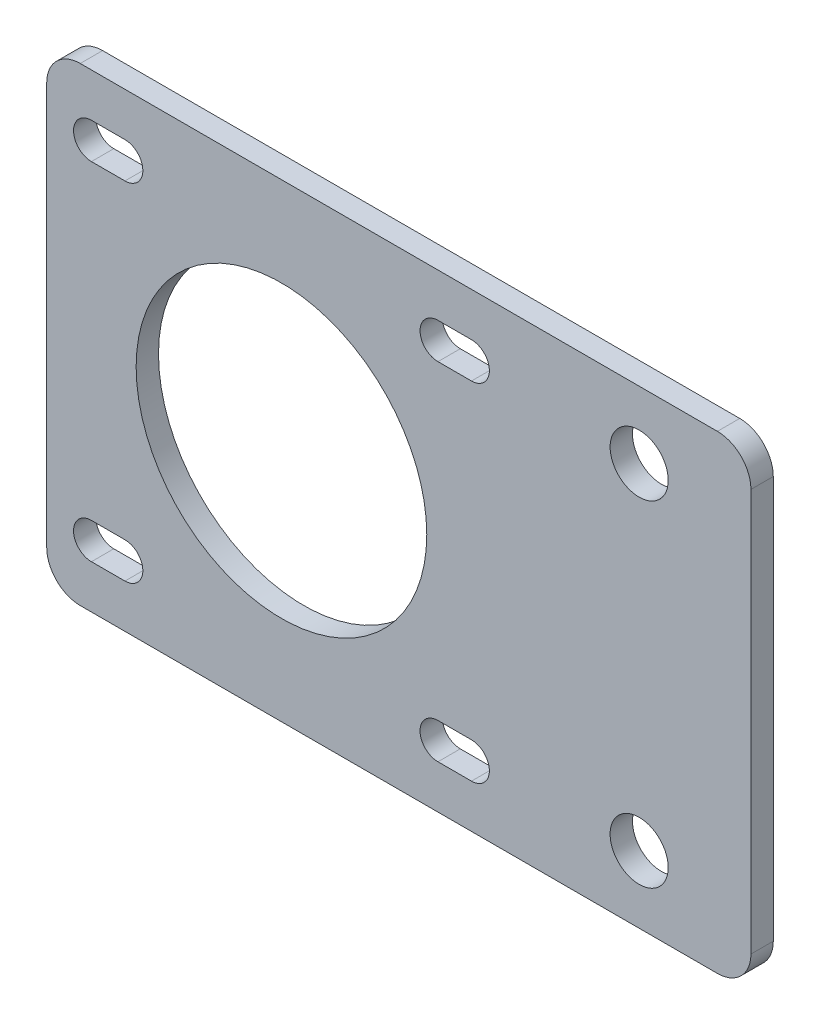
ISO-10303-21;
HEADER;
FILE_DESCRIPTION(('STEP AP214'),'2;1');
FILE_NAME('part.step','',(''),(''),'','','');
FILE_SCHEMA(('AUTOMOTIVE_DESIGN { 1 0 10303 214 1 1 1 1 }'));
ENDSEC;
DATA;
#1=APPLICATION_CONTEXT('core data for automotive mechanical design processes');
#2=APPLICATION_PROTOCOL_DEFINITION('international standard','automotive_design',2000,#1);
#3=PRODUCT_CONTEXT('',#1,'mechanical');
#4=PRODUCT('Part','Part','',(#3));
#5=PRODUCT_RELATED_PRODUCT_CATEGORY('part','',(#4));
#6=PRODUCT_DEFINITION_FORMATION('','',#4);
#7=PRODUCT_DEFINITION_CONTEXT('part definition',#1,'design');
#8=PRODUCT_DEFINITION('design','',#6,#7);
#9=PRODUCT_DEFINITION_SHAPE('','',#8);
#10=(LENGTH_UNIT() NAMED_UNIT(*) SI_UNIT(.MILLI.,.METRE.));
#11=(NAMED_UNIT(*) PLANE_ANGLE_UNIT() SI_UNIT($,.RADIAN.));
#12=(NAMED_UNIT(*) SI_UNIT($,.STERADIAN.) SOLID_ANGLE_UNIT());
#13=UNCERTAINTY_MEASURE_WITH_UNIT(LENGTH_MEASURE(1.E-05),#10,'distance_accuracy_value','');
#14=(GEOMETRIC_REPRESENTATION_CONTEXT(3) GLOBAL_UNCERTAINTY_ASSIGNED_CONTEXT((#13)) GLOBAL_UNIT_ASSIGNED_CONTEXT((#10,
#11,#12)) REPRESENTATION_CONTEXT('',''));
#15=CARTESIAN_POINT('',(0.,0.,0.));
#16=DIRECTION('',(0.,0.,1.));
#17=DIRECTION('',(1.,0.,0.));
#18=AXIS2_PLACEMENT_3D('',#15,#16,#17);
#19=CARTESIAN_POINT('',(39.,18.,-2.));
#20=DIRECTION('',(0.,0.,1.));
#21=DIRECTION('',(1.,0.,0.));
#22=AXIS2_PLACEMENT_3D('',#19,#20,#21);
#23=CYLINDRICAL_SURFACE('',#22,3.);
#24=CARTESIAN_POINT('',(39.,18.,0.));
#25=DIRECTION('',(0.,0.,1.));
#26=DIRECTION('',(1.,0.,0.));
#27=AXIS2_PLACEMENT_3D('',#24,#25,#26);
#28=CIRCLE('',#27,3.);
#29=CARTESIAN_POINT('',(42.,18.,0.));
#30=VERTEX_POINT('',#29);
#31=CARTESIAN_POINT('',(39.,21.,0.));
#32=VERTEX_POINT('',#31);
#33=EDGE_CURVE('E347',#30,#32,#28,.T.);
#34=ORIENTED_EDGE('',*,*,#33,.F.);
#35=DIRECTION('',(0.,0.,1.));
#36=VECTOR('',#35,1.);
#37=CARTESIAN_POINT('',(42.,18.,-2.));
#38=LINE('',#37,#36);
#39=CARTESIAN_POINT('',(42.,18.,-2.));
#40=VERTEX_POINT('',#39);
#41=EDGE_CURVE('E11',#40,#30,#38,.T.);
#42=ORIENTED_EDGE('',*,*,#41,.F.);
#43=CARTESIAN_POINT('',(39.,18.,-2.));
#44=DIRECTION('',(0.,0.,1.));
#45=DIRECTION('',(1.,0.,0.));
#46=AXIS2_PLACEMENT_3D('',#43,#44,#45);
#47=CIRCLE('',#46,3.);
#48=CARTESIAN_POINT('',(39.,21.,-2.));
#49=VERTEX_POINT('',#48);
#50=EDGE_CURVE('E350',#40,#49,#47,.T.);
#51=ORIENTED_EDGE('',*,*,#50,.T.);
#52=DIRECTION('',(0.,0.,1.));
#53=VECTOR('',#52,1.);
#54=CARTESIAN_POINT('',(39.,21.,-2.));
#55=LINE('',#54,#53);
#56=EDGE_CURVE('E41',#49,#32,#55,.T.);
#57=ORIENTED_EDGE('',*,*,#56,.T.);
#58=EDGE_LOOP('',(#34,#42,#51,#57));
#59=FACE_BOUND('',#58,.T.);
#60=ADVANCED_FACE('F38',(#59),#23,.T.);
#61=CARTESIAN_POINT('',(42.,18.,-2.));
#62=DIRECTION('',(1.,0.,0.));
#63=DIRECTION('',(0.,0.,-1.));
#64=AXIS2_PLACEMENT_3D('',#61,#62,#63);
#65=PLANE('',#64);
#66=DIRECTION('',(0.,1.,0.));
#67=VECTOR('',#66,1.);
#68=CARTESIAN_POINT('',(42.,18.,0.));
#69=LINE('',#68,#67);
#70=CARTESIAN_POINT('',(42.,-18.,0.));
#71=VERTEX_POINT('',#70);
#72=EDGE_CURVE('E354',#71,#30,#69,.T.);
#73=ORIENTED_EDGE('',*,*,#72,.F.);
#74=DIRECTION('',(0.,0.,1.));
#75=VECTOR('',#74,1.);
#76=CARTESIAN_POINT('',(42.,-18.,-2.));
#77=LINE('',#76,#75);
#78=CARTESIAN_POINT('',(42.,-18.,-2.));
#79=VERTEX_POINT('',#78);
#80=EDGE_CURVE('E46',#79,#71,#77,.T.);
#81=ORIENTED_EDGE('',*,*,#80,.F.);
#82=DIRECTION('',(0.,1.,0.));
#83=VECTOR('',#82,1.);
#84=CARTESIAN_POINT('',(42.,18.,-2.));
#85=LINE('',#84,#83);
#86=EDGE_CURVE('E372',#79,#40,#85,.T.);
#87=ORIENTED_EDGE('',*,*,#86,.T.);
#88=ORIENTED_EDGE('',*,*,#41,.T.);
#89=EDGE_LOOP('',(#73,#81,#87,#88));
#90=FACE_BOUND('',#89,.T.);
#91=ADVANCED_FACE('F419',(#90),#65,.T.);
#92=CARTESIAN_POINT('',(39.,-18.,-2.));
#93=DIRECTION('',(0.,0.,1.));
#94=DIRECTION('',(1.,0.,0.));
#95=AXIS2_PLACEMENT_3D('',#92,#93,#94);
#96=CYLINDRICAL_SURFACE('',#95,3.);
#97=CARTESIAN_POINT('',(39.,-18.,0.));
#98=DIRECTION('',(0.,0.,1.));
#99=DIRECTION('',(1.,0.,0.));
#100=AXIS2_PLACEMENT_3D('',#97,#98,#99);
#101=CIRCLE('',#100,3.);
#102=CARTESIAN_POINT('',(39.,-21.,0.));
#103=VERTEX_POINT('',#102);
#104=EDGE_CURVE('E392',#103,#71,#101,.T.);
#105=ORIENTED_EDGE('',*,*,#104,.F.);
#106=DIRECTION('',(0.,0.,1.));
#107=VECTOR('',#106,1.);
#108=CARTESIAN_POINT('',(39.,-21.,-2.));
#109=LINE('',#108,#107);
#110=CARTESIAN_POINT('',(39.,-21.,-2.));
#111=VERTEX_POINT('',#110);
#112=EDGE_CURVE('E398',#111,#103,#109,.T.);
#113=ORIENTED_EDGE('',*,*,#112,.F.);
#114=CARTESIAN_POINT('',(39.,-18.,-2.));
#115=DIRECTION('',(0.,0.,1.));
#116=DIRECTION('',(1.,0.,0.));
#117=AXIS2_PLACEMENT_3D('',#114,#115,#116);
#118=CIRCLE('',#117,3.);
#119=EDGE_CURVE('E369',#111,#79,#118,.T.);
#120=ORIENTED_EDGE('',*,*,#119,.T.);
#121=ORIENTED_EDGE('',*,*,#80,.T.);
#122=EDGE_LOOP('',(#105,#113,#120,#121));
#123=FACE_BOUND('',#122,.T.);
#124=ADVANCED_FACE('F439',(#123),#96,.T.);
#125=CARTESIAN_POINT('',(39.,-21.,-2.));
#126=DIRECTION('',(0.,-1.,0.));
#127=DIRECTION('',(1.,0.,0.));
#128=AXIS2_PLACEMENT_3D('',#125,#126,#127);
#129=PLANE('',#128);
#130=DIRECTION('',(1.,0.,0.));
#131=VECTOR('',#130,1.);
#132=CARTESIAN_POINT('',(39.,-21.,0.));
#133=LINE('',#132,#131);
#134=CARTESIAN_POINT('',(-18.,-21.,0.));
#135=VERTEX_POINT('',#134);
#136=EDGE_CURVE('E389',#135,#103,#133,.T.);
#137=ORIENTED_EDGE('',*,*,#136,.F.);
#138=DIRECTION('',(0.,0.,1.));
#139=VECTOR('',#138,1.);
#140=CARTESIAN_POINT('',(-18.,-21.,-2.));
#141=LINE('',#140,#139);
#142=CARTESIAN_POINT('',(-18.,-21.,-2.));
#143=VERTEX_POINT('',#142);
#144=EDGE_CURVE('E400',#143,#135,#141,.T.);
#145=ORIENTED_EDGE('',*,*,#144,.F.);
#146=DIRECTION('',(1.,0.,0.));
#147=VECTOR('',#146,1.);
#148=CARTESIAN_POINT('',(39.,-21.,-2.));
#149=LINE('',#148,#147);
#150=EDGE_CURVE('E366',#143,#111,#149,.T.);
#151=ORIENTED_EDGE('',*,*,#150,.T.);
#152=ORIENTED_EDGE('',*,*,#112,.T.);
#153=EDGE_LOOP('',(#137,#145,#151,#152));
#154=FACE_BOUND('',#153,.T.);
#155=ADVANCED_FACE('F437',(#154),#129,.T.);
#156=CARTESIAN_POINT('',(-18.,-18.,-2.));
#157=DIRECTION('',(0.,0.,1.));
#158=DIRECTION('',(1.,0.,0.));
#159=AXIS2_PLACEMENT_3D('',#156,#157,#158);
#160=CYLINDRICAL_SURFACE('',#159,3.);
#161=CARTESIAN_POINT('',(-18.,-18.,0.));
#162=DIRECTION('',(0.,0.,1.));
#163=DIRECTION('',(1.,0.,0.));
#164=AXIS2_PLACEMENT_3D('',#161,#162,#163);
#165=CIRCLE('',#164,3.);
#166=CARTESIAN_POINT('',(-21.,-18.,0.));
#167=VERTEX_POINT('',#166);
#168=EDGE_CURVE('E386',#167,#135,#165,.T.);
#169=ORIENTED_EDGE('',*,*,#168,.F.);
#170=DIRECTION('',(0.,0.,1.));
#171=VECTOR('',#170,1.);
#172=CARTESIAN_POINT('',(-21.,-18.,-2.));
#173=LINE('',#172,#171);
#174=CARTESIAN_POINT('',(-21.,-18.,-2.));
#175=VERTEX_POINT('',#174);
#176=EDGE_CURVE('E402',#175,#167,#173,.T.);
#177=ORIENTED_EDGE('',*,*,#176,.F.);
#178=CARTESIAN_POINT('',(-18.,-18.,-2.));
#179=DIRECTION('',(0.,0.,1.));
#180=DIRECTION('',(1.,0.,0.));
#181=AXIS2_PLACEMENT_3D('',#178,#179,#180);
#182=CIRCLE('',#181,3.);
#183=EDGE_CURVE('E363',#175,#143,#182,.T.);
#184=ORIENTED_EDGE('',*,*,#183,.T.);
#185=ORIENTED_EDGE('',*,*,#144,.T.);
#186=EDGE_LOOP('',(#169,#177,#184,#185));
#187=FACE_BOUND('',#186,.T.);
#188=ADVANCED_FACE('F433',(#187),#160,.T.);
#189=CARTESIAN_POINT('',(-21.,-18.,-2.));
#190=DIRECTION('',(-1.,0.,0.));
#191=DIRECTION('',(0.,0.,1.));
#192=AXIS2_PLACEMENT_3D('',#189,#190,#191);
#193=PLANE('',#192);
#194=DIRECTION('',(0.,-1.,0.));
#195=VECTOR('',#194,1.);
#196=CARTESIAN_POINT('',(-21.,-18.,0.));
#197=LINE('',#196,#195);
#198=CARTESIAN_POINT('',(-21.,18.,0.));
#199=VERTEX_POINT('',#198);
#200=EDGE_CURVE('E383',#199,#167,#197,.T.);
#201=ORIENTED_EDGE('',*,*,#200,.F.);
#202=DIRECTION('',(0.,0.,1.));
#203=VECTOR('',#202,1.);
#204=CARTESIAN_POINT('',(-21.,18.,-2.));
#205=LINE('',#204,#203);
#206=CARTESIAN_POINT('',(-21.,18.,-2.));
#207=VERTEX_POINT('',#206);
#208=EDGE_CURVE('E404',#207,#199,#205,.T.);
#209=ORIENTED_EDGE('',*,*,#208,.F.);
#210=DIRECTION('',(0.,-1.,0.));
#211=VECTOR('',#210,1.);
#212=CARTESIAN_POINT('',(-21.,-18.,-2.));
#213=LINE('',#212,#211);
#214=EDGE_CURVE('E360',#207,#175,#213,.T.);
#215=ORIENTED_EDGE('',*,*,#214,.T.);
#216=ORIENTED_EDGE('',*,*,#176,.T.);
#217=EDGE_LOOP('',(#201,#209,#215,#216));
#218=FACE_BOUND('',#217,.T.);
#219=ADVANCED_FACE('F431',(#218),#193,.T.);
#220=CARTESIAN_POINT('',(-18.,18.,-2.));
#221=DIRECTION('',(0.,0.,1.));
#222=DIRECTION('',(1.,0.,0.));
#223=AXIS2_PLACEMENT_3D('',#220,#221,#222);
#224=CYLINDRICAL_SURFACE('',#223,3.);
#225=CARTESIAN_POINT('',(-18.,18.,0.));
#226=DIRECTION('',(0.,0.,1.));
#227=DIRECTION('',(1.,0.,0.));
#228=AXIS2_PLACEMENT_3D('',#225,#226,#227);
#229=CIRCLE('',#228,3.);
#230=CARTESIAN_POINT('',(-18.,21.,0.));
#231=VERTEX_POINT('',#230);
#232=EDGE_CURVE('E380',#231,#199,#229,.T.);
#233=ORIENTED_EDGE('',*,*,#232,.F.);
#234=DIRECTION('',(0.,0.,1.));
#235=VECTOR('',#234,1.);
#236=CARTESIAN_POINT('',(-18.,21.,-2.));
#237=LINE('',#236,#235);
#238=CARTESIAN_POINT('',(-18.,21.,-2.));
#239=VERTEX_POINT('',#238);
#240=EDGE_CURVE('E405',#239,#231,#237,.T.);
#241=ORIENTED_EDGE('',*,*,#240,.F.);
#242=CARTESIAN_POINT('',(-18.,18.,-2.));
#243=DIRECTION('',(0.,0.,1.));
#244=DIRECTION('',(1.,0.,0.));
#245=AXIS2_PLACEMENT_3D('',#242,#243,#244);
#246=CIRCLE('',#245,3.);
#247=EDGE_CURVE('E357',#239,#207,#246,.T.);
#248=ORIENTED_EDGE('',*,*,#247,.T.);
#249=ORIENTED_EDGE('',*,*,#208,.T.);
#250=EDGE_LOOP('',(#233,#241,#248,#249));
#251=FACE_BOUND('',#250,.T.);
#252=ADVANCED_FACE('F427',(#251),#224,.T.);
#253=CARTESIAN_POINT('',(-18.,21.,-2.));
#254=DIRECTION('',(0.,1.,0.));
#255=DIRECTION('',(-1.,0.,0.));
#256=AXIS2_PLACEMENT_3D('',#253,#254,#255);
#257=PLANE('',#256);
#258=DIRECTION('',(-1.,0.,0.));
#259=VECTOR('',#258,1.);
#260=CARTESIAN_POINT('',(-18.,21.,0.));
#261=LINE('',#260,#259);
#262=EDGE_CURVE('E377',#32,#231,#261,.T.);
#263=ORIENTED_EDGE('',*,*,#262,.F.);
#264=ORIENTED_EDGE('',*,*,#56,.F.);
#265=DIRECTION('',(-1.,0.,0.));
#266=VECTOR('',#265,1.);
#267=CARTESIAN_POINT('',(-18.,21.,-2.));
#268=LINE('',#267,#266);
#269=EDGE_CURVE('E353',#49,#239,#268,.T.);
#270=ORIENTED_EDGE('',*,*,#269,.T.);
#271=ORIENTED_EDGE('',*,*,#240,.T.);
#272=EDGE_LOOP('',(#263,#264,#270,#271));
#273=FACE_BOUND('',#272,.T.);
#274=ADVANCED_FACE('F413',(#273),#257,.T.);
#275=CARTESIAN_POINT('',(39.,18.,-2.));
#276=DIRECTION('',(0.,0.,1.));
#277=DIRECTION('',(1.,0.,0.));
#278=AXIS2_PLACEMENT_3D('',#275,#276,#277);
#279=PLANE('',#278);
#280=DIRECTION('',(1.,0.,0.));
#281=VECTOR('',#280,1.);
#282=CARTESIAN_POINT('',(17.,-17.1,-2.));
#283=LINE('',#282,#281);
#284=CARTESIAN_POINT('',(14.,-17.1,-2.));
#285=VERTEX_POINT('',#284);
#286=CARTESIAN_POINT('',(17.,-17.1,-2.));
#287=VERTEX_POINT('',#286);
#288=EDGE_CURVE('E207',#285,#287,#283,.T.);
#289=ORIENTED_EDGE('',*,*,#288,.T.);
#290=CARTESIAN_POINT('',(17.,-15.5,-2.));
#291=DIRECTION('',(0.,0.,1.));
#292=DIRECTION('',(1.,0.,0.));
#293=AXIS2_PLACEMENT_3D('',#290,#291,#292);
#294=CIRCLE('',#293,1.6);
#295=CARTESIAN_POINT('',(17.,-13.9,-2.));
#296=VERTEX_POINT('',#295);
#297=EDGE_CURVE('E201',#287,#296,#294,.T.);
#298=ORIENTED_EDGE('',*,*,#297,.T.);
#299=DIRECTION('',(-1.,0.,0.));
#300=VECTOR('',#299,1.);
#301=CARTESIAN_POINT('',(17.,-13.9,-2.));
#302=LINE('',#301,#300);
#303=CARTESIAN_POINT('',(14.,-13.9,-2.));
#304=VERTEX_POINT('',#303);
#305=EDGE_CURVE('E210',#296,#304,#302,.T.);
#306=ORIENTED_EDGE('',*,*,#305,.T.);
#307=CARTESIAN_POINT('',(14.,-15.5,-2.));
#308=DIRECTION('',(0.,0.,1.));
#309=DIRECTION('',(1.,0.,0.));
#310=AXIS2_PLACEMENT_3D('',#307,#308,#309);
#311=CIRCLE('',#310,1.6);
#312=EDGE_CURVE('E54',#304,#285,#311,.T.);
#313=ORIENTED_EDGE('',*,*,#312,.T.);
#314=EDGE_LOOP('',(#289,#298,#306,#313));
#315=FACE_BOUND('',#314,.T.);
#316=DIRECTION('',(1.,0.,0.));
#317=VECTOR('',#316,1.);
#318=CARTESIAN_POINT('',(17.,13.9,-2.));
#319=LINE('',#318,#317);
#320=CARTESIAN_POINT('',(14.,13.9,-2.));
#321=VERTEX_POINT('',#320);
#322=CARTESIAN_POINT('',(17.,13.9,-2.));
#323=VERTEX_POINT('',#322);
#324=EDGE_CURVE('E246',#321,#323,#319,.T.);
#325=ORIENTED_EDGE('',*,*,#324,.T.);
#326=CARTESIAN_POINT('',(17.,15.5,-2.));
#327=DIRECTION('',(0.,0.,1.));
#328=DIRECTION('',(1.,0.,0.));
#329=AXIS2_PLACEMENT_3D('',#326,#327,#328);
#330=CIRCLE('',#329,1.6);
#331=CARTESIAN_POINT('',(17.,17.1,-2.));
#332=VERTEX_POINT('',#331);
#333=EDGE_CURVE('E236',#323,#332,#330,.T.);
#334=ORIENTED_EDGE('',*,*,#333,.T.);
#335=DIRECTION('',(-1.,0.,0.));
#336=VECTOR('',#335,1.);
#337=CARTESIAN_POINT('',(17.,17.1,-2.));
#338=LINE('',#337,#336);
#339=CARTESIAN_POINT('',(14.,17.1,-2.));
#340=VERTEX_POINT('',#339);
#341=EDGE_CURVE('E239',#332,#340,#338,.T.);
#342=ORIENTED_EDGE('',*,*,#341,.T.);
#343=CARTESIAN_POINT('',(14.,15.5,-2.));
#344=DIRECTION('',(0.,0.,1.));
#345=DIRECTION('',(1.,0.,0.));
#346=AXIS2_PLACEMENT_3D('',#343,#344,#345);
#347=CIRCLE('',#346,1.6);
#348=EDGE_CURVE('E243',#340,#321,#347,.T.);
#349=ORIENTED_EDGE('',*,*,#348,.T.);
#350=EDGE_LOOP('',(#325,#334,#342,#349));
#351=FACE_BOUND('',#350,.T.);
#352=DIRECTION('',(1.,0.,0.));
#353=VECTOR('',#352,1.);
#354=CARTESIAN_POINT('',(-14.,-17.1,-2.));
#355=LINE('',#354,#353);
#356=CARTESIAN_POINT('',(-17.,-17.1,-2.));
#357=VERTEX_POINT('',#356);
#358=CARTESIAN_POINT('',(-14.,-17.1,-2.));
#359=VERTEX_POINT('',#358);
#360=EDGE_CURVE('E278',#357,#359,#355,.T.);
#361=ORIENTED_EDGE('',*,*,#360,.T.);
#362=CARTESIAN_POINT('',(-14.,-15.5,-2.));
#363=DIRECTION('',(0.,0.,1.));
#364=DIRECTION('',(1.,0.,0.));
#365=AXIS2_PLACEMENT_3D('',#362,#363,#364);
#366=CIRCLE('',#365,1.6);
#367=CARTESIAN_POINT('',(-14.,-13.9,-2.));
#368=VERTEX_POINT('',#367);
#369=EDGE_CURVE('E268',#359,#368,#366,.T.);
#370=ORIENTED_EDGE('',*,*,#369,.T.);
#371=DIRECTION('',(-1.,0.,0.));
#372=VECTOR('',#371,1.);
#373=CARTESIAN_POINT('',(-14.,-13.9,-2.));
#374=LINE('',#373,#372);
#375=CARTESIAN_POINT('',(-17.,-13.9,-2.));
#376=VERTEX_POINT('',#375);
#377=EDGE_CURVE('E271',#368,#376,#374,.T.);
#378=ORIENTED_EDGE('',*,*,#377,.T.);
#379=CARTESIAN_POINT('',(-17.,-15.5,-2.));
#380=DIRECTION('',(0.,0.,1.));
#381=DIRECTION('',(1.,0.,0.));
#382=AXIS2_PLACEMENT_3D('',#379,#380,#381);
#383=CIRCLE('',#382,1.6);
#384=EDGE_CURVE('E275',#376,#357,#383,.T.);
#385=ORIENTED_EDGE('',*,*,#384,.T.);
#386=EDGE_LOOP('',(#361,#370,#378,#385));
#387=FACE_BOUND('',#386,.T.);
#388=CARTESIAN_POINT('',(32.,15.,-2.));
#389=DIRECTION('',(0.,0.,1.));
#390=DIRECTION('',(1.,0.,0.));
#391=AXIS2_PLACEMENT_3D('',#388,#389,#390);
#392=CIRCLE('',#391,2.6);
#393=CARTESIAN_POINT('',(34.6,15.,-2.));
#394=VERTEX_POINT('',#393);
#395=EDGE_CURVE('E300',#394,#394,#392,.T.);
#396=ORIENTED_EDGE('',*,*,#395,.T.);
#397=EDGE_LOOP('',(#396));
#398=FACE_BOUND('',#397,.T.);
#399=CARTESIAN_POINT('',(32.,-15.,-2.));
#400=DIRECTION('',(0.,0.,1.));
#401=DIRECTION('',(1.,0.,0.));
#402=AXIS2_PLACEMENT_3D('',#399,#400,#401);
#403=CIRCLE('',#402,2.6);
#404=CARTESIAN_POINT('',(34.6,-15.,-2.));
#405=VERTEX_POINT('',#404);
#406=EDGE_CURVE('E306',#405,#405,#403,.T.);
#407=ORIENTED_EDGE('',*,*,#406,.T.);
#408=EDGE_LOOP('',(#407));
#409=FACE_BOUND('',#408,.T.);
#410=DIRECTION('',(1.,0.,0.));
#411=VECTOR('',#410,1.);
#412=CARTESIAN_POINT('',(-14.,13.9,-2.));
#413=LINE('',#412,#411);
#414=CARTESIAN_POINT('',(-17.,13.9,-2.));
#415=VERTEX_POINT('',#414);
#416=CARTESIAN_POINT('',(-14.,13.9,-2.));
#417=VERTEX_POINT('',#416);
#418=EDGE_CURVE('E322',#415,#417,#413,.T.);
#419=ORIENTED_EDGE('',*,*,#418,.T.);
#420=CARTESIAN_POINT('',(-14.,15.5,-2.));
#421=DIRECTION('',(0.,0.,1.));
#422=DIRECTION('',(1.,0.,0.));
#423=AXIS2_PLACEMENT_3D('',#420,#421,#422);
#424=CIRCLE('',#423,1.6);
#425=CARTESIAN_POINT('',(-14.,17.1,-2.));
#426=VERTEX_POINT('',#425);
#427=EDGE_CURVE('E312',#417,#426,#424,.T.);
#428=ORIENTED_EDGE('',*,*,#427,.T.);
#429=DIRECTION('',(-1.,0.,0.));
#430=VECTOR('',#429,1.);
#431=CARTESIAN_POINT('',(-14.,17.1,-2.));
#432=LINE('',#431,#430);
#433=CARTESIAN_POINT('',(-17.,17.1,-2.));
#434=VERTEX_POINT('',#433);
#435=EDGE_CURVE('E315',#426,#434,#432,.T.);
#436=ORIENTED_EDGE('',*,*,#435,.T.);
#437=CARTESIAN_POINT('',(-17.,15.5,-2.));
#438=DIRECTION('',(0.,0.,1.));
#439=DIRECTION('',(1.,0.,0.));
#440=AXIS2_PLACEMENT_3D('',#437,#438,#439);
#441=CIRCLE('',#440,1.6);
#442=EDGE_CURVE('E319',#434,#415,#441,.T.);
#443=ORIENTED_EDGE('',*,*,#442,.T.);
#444=EDGE_LOOP('',(#419,#428,#436,#443));
#445=FACE_BOUND('',#444,.T.);
#446=CARTESIAN_POINT('',(0.,0.,-2.));
#447=DIRECTION('',(0.,0.,1.));
#448=DIRECTION('',(1.,0.,0.));
#449=AXIS2_PLACEMENT_3D('',#446,#447,#448);
#450=CIRCLE('',#449,13.);
#451=CARTESIAN_POINT('',(13.,0.,-2.));
#452=VERTEX_POINT('',#451);
#453=EDGE_CURVE('E344',#452,#452,#450,.T.);
#454=ORIENTED_EDGE('',*,*,#453,.T.);
#455=EDGE_LOOP('',(#454));
#456=FACE_BOUND('',#455,.T.);
#457=ORIENTED_EDGE('',*,*,#50,.F.);
#458=ORIENTED_EDGE('',*,*,#86,.F.);
#459=ORIENTED_EDGE('',*,*,#119,.F.);
#460=ORIENTED_EDGE('',*,*,#150,.F.);
#461=ORIENTED_EDGE('',*,*,#183,.F.);
#462=ORIENTED_EDGE('',*,*,#214,.F.);
#463=ORIENTED_EDGE('',*,*,#247,.F.);
#464=ORIENTED_EDGE('',*,*,#269,.F.);
#465=EDGE_LOOP('',(#457,#458,#459,#460,#461,#462,#463,#464));
#466=FACE_BOUND('',#465,.T.);
#467=ADVANCED_FACE('F214',(#315,#351,#387,#398,#409,#445,#456,#466),#279,.F.);
#468=CARTESIAN_POINT('',(39.,18.,0.));
#469=DIRECTION('',(0.,0.,1.));
#470=DIRECTION('',(1.,0.,0.));
#471=AXIS2_PLACEMENT_3D('',#468,#469,#470);
#472=PLANE('',#471);
#473=CARTESIAN_POINT('',(17.,-15.5,0.));
#474=DIRECTION('',(0.,0.,1.));
#475=DIRECTION('',(1.,0.,0.));
#476=AXIS2_PLACEMENT_3D('',#473,#474,#475);
#477=CIRCLE('',#476,1.6);
#478=CARTESIAN_POINT('',(17.,-17.1,0.));
#479=VERTEX_POINT('',#478);
#480=CARTESIAN_POINT('',(17.,-13.9,0.));
#481=VERTEX_POINT('',#480);
#482=EDGE_CURVE('E62',#479,#481,#477,.T.);
#483=ORIENTED_EDGE('',*,*,#482,.F.);
#484=DIRECTION('',(1.,0.,0.));
#485=VECTOR('',#484,1.);
#486=CARTESIAN_POINT('',(17.,-17.1,0.));
#487=LINE('',#486,#485);
#488=CARTESIAN_POINT('',(14.,-17.1,0.));
#489=VERTEX_POINT('',#488);
#490=EDGE_CURVE('E217',#489,#479,#487,.T.);
#491=ORIENTED_EDGE('',*,*,#490,.F.);
#492=CARTESIAN_POINT('',(14.,-15.5,0.));
#493=DIRECTION('',(0.,0.,1.));
#494=DIRECTION('',(1.,0.,0.));
#495=AXIS2_PLACEMENT_3D('',#492,#493,#494);
#496=CIRCLE('',#495,1.6);
#497=CARTESIAN_POINT('',(14.,-13.9,0.));
#498=VERTEX_POINT('',#497);
#499=EDGE_CURVE('E220',#498,#489,#496,.T.);
#500=ORIENTED_EDGE('',*,*,#499,.F.);
#501=DIRECTION('',(-1.,0.,0.));
#502=VECTOR('',#501,1.);
#503=CARTESIAN_POINT('',(17.,-13.9,0.));
#504=LINE('',#503,#502);
#505=EDGE_CURVE('E226',#481,#498,#504,.T.);
#506=ORIENTED_EDGE('',*,*,#505,.F.);
#507=EDGE_LOOP('',(#483,#491,#500,#506));
#508=FACE_BOUND('',#507,.T.);
#509=CARTESIAN_POINT('',(17.,15.5,0.));
#510=DIRECTION('',(0.,0.,1.));
#511=DIRECTION('',(1.,0.,0.));
#512=AXIS2_PLACEMENT_3D('',#509,#510,#511);
#513=CIRCLE('',#512,1.6);
#514=CARTESIAN_POINT('',(17.,13.9,0.));
#515=VERTEX_POINT('',#514);
#516=CARTESIAN_POINT('',(17.,17.1,0.));
#517=VERTEX_POINT('',#516);
#518=EDGE_CURVE('E232',#515,#517,#513,.T.);
#519=ORIENTED_EDGE('',*,*,#518,.F.);
#520=DIRECTION('',(1.,0.,0.));
#521=VECTOR('',#520,1.);
#522=CARTESIAN_POINT('',(17.,13.9,0.));
#523=LINE('',#522,#521);
#524=CARTESIAN_POINT('',(14.,13.9,0.));
#525=VERTEX_POINT('',#524);
#526=EDGE_CURVE('E240',#525,#515,#523,.T.);
#527=ORIENTED_EDGE('',*,*,#526,.F.);
#528=CARTESIAN_POINT('',(14.,15.5,0.));
#529=DIRECTION('',(0.,0.,1.));
#530=DIRECTION('',(1.,0.,0.));
#531=AXIS2_PLACEMENT_3D('',#528,#529,#530);
#532=CIRCLE('',#531,1.6);
#533=CARTESIAN_POINT('',(14.,17.1,0.));
#534=VERTEX_POINT('',#533);
#535=EDGE_CURVE('E254',#534,#525,#532,.T.);
#536=ORIENTED_EDGE('',*,*,#535,.F.);
#537=DIRECTION('',(-1.,0.,0.));
#538=VECTOR('',#537,1.);
#539=CARTESIAN_POINT('',(17.,17.1,0.));
#540=LINE('',#539,#538);
#541=EDGE_CURVE('E251',#517,#534,#540,.T.);
#542=ORIENTED_EDGE('',*,*,#541,.F.);
#543=EDGE_LOOP('',(#519,#527,#536,#542));
#544=FACE_BOUND('',#543,.T.);
#545=CARTESIAN_POINT('',(-14.,-15.5,0.));
#546=DIRECTION('',(0.,0.,1.));
#547=DIRECTION('',(1.,0.,0.));
#548=AXIS2_PLACEMENT_3D('',#545,#546,#547);
#549=CIRCLE('',#548,1.6);
#550=CARTESIAN_POINT('',(-14.,-17.1,0.));
#551=VERTEX_POINT('',#550);
#552=CARTESIAN_POINT('',(-14.,-13.9,0.));
#553=VERTEX_POINT('',#552);
#554=EDGE_CURVE('E261',#551,#553,#549,.T.);
#555=ORIENTED_EDGE('',*,*,#554,.F.);
#556=DIRECTION('',(1.,0.,0.));
#557=VECTOR('',#556,1.);
#558=CARTESIAN_POINT('',(-14.,-17.1,0.));
#559=LINE('',#558,#557);
#560=CARTESIAN_POINT('',(-17.,-17.1,0.));
#561=VERTEX_POINT('',#560);
#562=EDGE_CURVE('E272',#561,#551,#559,.T.);
#563=ORIENTED_EDGE('',*,*,#562,.F.);
#564=CARTESIAN_POINT('',(-17.,-15.5,0.));
#565=DIRECTION('',(0.,0.,1.));
#566=DIRECTION('',(1.,0.,0.));
#567=AXIS2_PLACEMENT_3D('',#564,#565,#566);
#568=CIRCLE('',#567,1.6);
#569=CARTESIAN_POINT('',(-17.,-13.9,0.));
#570=VERTEX_POINT('',#569);
#571=EDGE_CURVE('E286',#570,#561,#568,.T.);
#572=ORIENTED_EDGE('',*,*,#571,.F.);
#573=DIRECTION('',(-1.,0.,0.));
#574=VECTOR('',#573,1.);
#575=CARTESIAN_POINT('',(-14.,-13.9,0.));
#576=LINE('',#575,#574);
#577=EDGE_CURVE('E283',#553,#570,#576,.T.);
#578=ORIENTED_EDGE('',*,*,#577,.F.);
#579=EDGE_LOOP('',(#555,#563,#572,#578));
#580=FACE_BOUND('',#579,.T.);
#581=CARTESIAN_POINT('',(32.,15.,0.));
#582=DIRECTION('',(0.,0.,1.));
#583=DIRECTION('',(1.,0.,0.));
#584=AXIS2_PLACEMENT_3D('',#581,#582,#583);
#585=CIRCLE('',#584,2.6);
#586=CARTESIAN_POINT('',(34.6,15.,0.));
#587=VERTEX_POINT('',#586);
#588=EDGE_CURVE('E293',#587,#587,#585,.T.);
#589=ORIENTED_EDGE('',*,*,#588,.F.);
#590=EDGE_LOOP('',(#589));
#591=FACE_BOUND('',#590,.T.);
#592=CARTESIAN_POINT('',(32.,-15.,0.));
#593=DIRECTION('',(0.,0.,1.));
#594=DIRECTION('',(1.,0.,0.));
#595=AXIS2_PLACEMENT_3D('',#592,#593,#594);
#596=CIRCLE('',#595,2.6);
#597=CARTESIAN_POINT('',(34.6,-15.,0.));
#598=VERTEX_POINT('',#597);
#599=EDGE_CURVE('E303',#598,#598,#596,.T.);
#600=ORIENTED_EDGE('',*,*,#599,.F.);
#601=EDGE_LOOP('',(#600));
#602=FACE_BOUND('',#601,.T.);
#603=CARTESIAN_POINT('',(-14.,15.5,0.));
#604=DIRECTION('',(0.,0.,1.));
#605=DIRECTION('',(1.,0.,0.));
#606=AXIS2_PLACEMENT_3D('',#603,#604,#605);
#607=CIRCLE('',#606,1.6);
#608=CARTESIAN_POINT('',(-14.,13.9,0.));
#609=VERTEX_POINT('',#608);
#610=CARTESIAN_POINT('',(-14.,17.1,0.));
#611=VERTEX_POINT('',#610);
#612=EDGE_CURVE('E309',#609,#611,#607,.T.);
#613=ORIENTED_EDGE('',*,*,#612,.F.);
#614=DIRECTION('',(1.,0.,0.));
#615=VECTOR('',#614,1.);
#616=CARTESIAN_POINT('',(-14.,13.9,0.));
#617=LINE('',#616,#615);
#618=CARTESIAN_POINT('',(-17.,13.9,0.));
#619=VERTEX_POINT('',#618);
#620=EDGE_CURVE('E316',#619,#609,#617,.T.);
#621=ORIENTED_EDGE('',*,*,#620,.F.);
#622=CARTESIAN_POINT('',(-17.,15.5,0.));
#623=DIRECTION('',(0.,0.,1.));
#624=DIRECTION('',(1.,0.,0.));
#625=AXIS2_PLACEMENT_3D('',#622,#623,#624);
#626=CIRCLE('',#625,1.6);
#627=CARTESIAN_POINT('',(-17.,17.1,0.));
#628=VERTEX_POINT('',#627);
#629=EDGE_CURVE('E330',#628,#619,#626,.T.);
#630=ORIENTED_EDGE('',*,*,#629,.F.);
#631=DIRECTION('',(-1.,0.,0.));
#632=VECTOR('',#631,1.);
#633=CARTESIAN_POINT('',(-14.,17.1,0.));
#634=LINE('',#633,#632);
#635=EDGE_CURVE('E327',#611,#628,#634,.T.);
#636=ORIENTED_EDGE('',*,*,#635,.F.);
#637=EDGE_LOOP('',(#613,#621,#630,#636));
#638=FACE_BOUND('',#637,.T.);
#639=CARTESIAN_POINT('',(0.,0.,0.));
#640=DIRECTION('',(0.,0.,1.));
#641=DIRECTION('',(1.,0.,0.));
#642=AXIS2_PLACEMENT_3D('',#639,#640,#641);
#643=CIRCLE('',#642,13.);
#644=CARTESIAN_POINT('',(13.,0.,0.));
#645=VERTEX_POINT('',#644);
#646=EDGE_CURVE('E337',#645,#645,#643,.T.);
#647=ORIENTED_EDGE('',*,*,#646,.F.);
#648=EDGE_LOOP('',(#647));
#649=FACE_BOUND('',#648,.T.);
#650=ORIENTED_EDGE('',*,*,#33,.T.);
#651=ORIENTED_EDGE('',*,*,#262,.T.);
#652=ORIENTED_EDGE('',*,*,#232,.T.);
#653=ORIENTED_EDGE('',*,*,#200,.T.);
#654=ORIENTED_EDGE('',*,*,#168,.T.);
#655=ORIENTED_EDGE('',*,*,#136,.T.);
#656=ORIENTED_EDGE('',*,*,#104,.T.);
#657=ORIENTED_EDGE('',*,*,#72,.T.);
#658=EDGE_LOOP('',(#650,#651,#652,#653,#654,#655,#656,#657));
#659=FACE_BOUND('',#658,.T.);
#660=ADVANCED_FACE('F415',(#508,#544,#580,#591,#602,#638,#649,#659),#472,.T.);
#661=CARTESIAN_POINT('',(0.,0.,-2.));
#662=DIRECTION('',(0.,0.,1.));
#663=DIRECTION('',(1.,0.,0.));
#664=AXIS2_PLACEMENT_3D('',#661,#662,#663);
#665=CYLINDRICAL_SURFACE('',#664,13.);
#666=ORIENTED_EDGE('',*,*,#453,.F.);
#667=EDGE_LOOP('',(#666));
#668=FACE_BOUND('',#667,.T.);
#669=ORIENTED_EDGE('',*,*,#646,.T.);
#670=EDGE_LOOP('',(#669));
#671=FACE_BOUND('',#670,.T.);
#672=ADVANCED_FACE('F521',(#668,#671),#665,.F.);
#673=CARTESIAN_POINT('',(-14.,15.5,-2.));
#674=DIRECTION('',(0.,0.,1.));
#675=DIRECTION('',(1.,0.,0.));
#676=AXIS2_PLACEMENT_3D('',#673,#674,#675);
#677=CYLINDRICAL_SURFACE('',#676,1.6);
#678=ORIENTED_EDGE('',*,*,#612,.T.);
#679=DIRECTION('',(0.,0.,1.));
#680=VECTOR('',#679,1.);
#681=CARTESIAN_POINT('',(-14.,17.1,-2.));
#682=LINE('',#681,#680);
#683=EDGE_CURVE('E325',#426,#611,#682,.T.);
#684=ORIENTED_EDGE('',*,*,#683,.F.);
#685=ORIENTED_EDGE('',*,*,#427,.F.);
#686=DIRECTION('',(0.,0.,1.));
#687=VECTOR('',#686,1.);
#688=CARTESIAN_POINT('',(-14.,13.9,-2.));
#689=LINE('',#688,#687);
#690=EDGE_CURVE('E335',#417,#609,#689,.T.);
#691=ORIENTED_EDGE('',*,*,#690,.T.);
#692=EDGE_LOOP('',(#678,#684,#685,#691));
#693=FACE_BOUND('',#692,.T.);
#694=ADVANCED_FACE('F532',(#693),#677,.F.);
#695=CARTESIAN_POINT('',(-14.,13.9,-2.));
#696=DIRECTION('',(0.,-1.,0.));
#697=DIRECTION('',(0.,0.,-1.));
#698=AXIS2_PLACEMENT_3D('',#695,#696,#697);
#699=PLANE('',#698);
#700=ORIENTED_EDGE('',*,*,#620,.T.);
#701=ORIENTED_EDGE('',*,*,#690,.F.);
#702=ORIENTED_EDGE('',*,*,#418,.F.);
#703=DIRECTION('',(0.,0.,1.));
#704=VECTOR('',#703,1.);
#705=CARTESIAN_POINT('',(-17.,13.9,-2.));
#706=LINE('',#705,#704);
#707=EDGE_CURVE('E338',#415,#619,#706,.T.);
#708=ORIENTED_EDGE('',*,*,#707,.T.);
#709=EDGE_LOOP('',(#700,#701,#702,#708));
#710=FACE_BOUND('',#709,.T.);
#711=ADVANCED_FACE('F543',(#710),#699,.F.);
#712=CARTESIAN_POINT('',(-17.,15.5,-2.));
#713=DIRECTION('',(0.,0.,1.));
#714=DIRECTION('',(1.,0.,0.));
#715=AXIS2_PLACEMENT_3D('',#712,#713,#714);
#716=CYLINDRICAL_SURFACE('',#715,1.6);
#717=ORIENTED_EDGE('',*,*,#629,.T.);
#718=ORIENTED_EDGE('',*,*,#707,.F.);
#719=ORIENTED_EDGE('',*,*,#442,.F.);
#720=DIRECTION('',(0.,0.,1.));
#721=VECTOR('',#720,1.);
#722=CARTESIAN_POINT('',(-17.,17.1,-2.));
#723=LINE('',#722,#721);
#724=EDGE_CURVE('E340',#434,#628,#723,.T.);
#725=ORIENTED_EDGE('',*,*,#724,.T.);
#726=EDGE_LOOP('',(#717,#718,#719,#725));
#727=FACE_BOUND('',#726,.T.);
#728=ADVANCED_FACE('F554',(#727),#716,.F.);
#729=CARTESIAN_POINT('',(-14.,17.1,-2.));
#730=DIRECTION('',(0.,1.,0.));
#731=DIRECTION('',(0.,0.,1.));
#732=AXIS2_PLACEMENT_3D('',#729,#730,#731);
#733=PLANE('',#732);
#734=ORIENTED_EDGE('',*,*,#635,.T.);
#735=ORIENTED_EDGE('',*,*,#724,.F.);
#736=ORIENTED_EDGE('',*,*,#435,.F.);
#737=ORIENTED_EDGE('',*,*,#683,.T.);
#738=EDGE_LOOP('',(#734,#735,#736,#737));
#739=FACE_BOUND('',#738,.T.);
#740=ADVANCED_FACE('F565',(#739),#733,.F.);
#741=CARTESIAN_POINT('',(32.,-15.,-2.));
#742=DIRECTION('',(0.,0.,1.));
#743=DIRECTION('',(1.,0.,0.));
#744=AXIS2_PLACEMENT_3D('',#741,#742,#743);
#745=CYLINDRICAL_SURFACE('',#744,2.6);
#746=ORIENTED_EDGE('',*,*,#406,.F.);
#747=EDGE_LOOP('',(#746));
#748=FACE_BOUND('',#747,.T.);
#749=ORIENTED_EDGE('',*,*,#599,.T.);
#750=EDGE_LOOP('',(#749));
#751=FACE_BOUND('',#750,.T.);
#752=ADVANCED_FACE('F576',(#748,#751),#745,.F.);
#753=CARTESIAN_POINT('',(32.,15.,-2.));
#754=DIRECTION('',(0.,0.,1.));
#755=DIRECTION('',(1.,0.,0.));
#756=AXIS2_PLACEMENT_3D('',#753,#754,#755);
#757=CYLINDRICAL_SURFACE('',#756,2.6);
#758=ORIENTED_EDGE('',*,*,#395,.F.);
#759=EDGE_LOOP('',(#758));
#760=FACE_BOUND('',#759,.T.);
#761=ORIENTED_EDGE('',*,*,#588,.T.);
#762=EDGE_LOOP('',(#761));
#763=FACE_BOUND('',#762,.T.);
#764=ADVANCED_FACE('F587',(#760,#763),#757,.F.);
#765=CARTESIAN_POINT('',(-14.,-15.5,-2.));
#766=DIRECTION('',(0.,0.,1.));
#767=DIRECTION('',(1.,0.,0.));
#768=AXIS2_PLACEMENT_3D('',#765,#766,#767);
#769=CYLINDRICAL_SURFACE('',#768,1.6);
#770=ORIENTED_EDGE('',*,*,#554,.T.);
#771=DIRECTION('',(0.,0.,1.));
#772=VECTOR('',#771,1.);
#773=CARTESIAN_POINT('',(-14.,-13.9,-2.));
#774=LINE('',#773,#772);
#775=EDGE_CURVE('E281',#368,#553,#774,.T.);
#776=ORIENTED_EDGE('',*,*,#775,.F.);
#777=ORIENTED_EDGE('',*,*,#369,.F.);
#778=DIRECTION('',(0.,0.,1.));
#779=VECTOR('',#778,1.);
#780=CARTESIAN_POINT('',(-14.,-17.1,-2.));
#781=LINE('',#780,#779);
#782=EDGE_CURVE('E291',#359,#551,#781,.T.);
#783=ORIENTED_EDGE('',*,*,#782,.T.);
#784=EDGE_LOOP('',(#770,#776,#777,#783));
#785=FACE_BOUND('',#784,.T.);
#786=ADVANCED_FACE('F598',(#785),#769,.F.);
#787=CARTESIAN_POINT('',(-14.,-17.1,-2.));
#788=DIRECTION('',(0.,-1.,0.));
#789=DIRECTION('',(0.,0.,-1.));
#790=AXIS2_PLACEMENT_3D('',#787,#788,#789);
#791=PLANE('',#790);
#792=ORIENTED_EDGE('',*,*,#562,.T.);
#793=ORIENTED_EDGE('',*,*,#782,.F.);
#794=ORIENTED_EDGE('',*,*,#360,.F.);
#795=DIRECTION('',(0.,0.,1.));
#796=VECTOR('',#795,1.);
#797=CARTESIAN_POINT('',(-17.,-17.1,-2.));
#798=LINE('',#797,#796);
#799=EDGE_CURVE('E294',#357,#561,#798,.T.);
#800=ORIENTED_EDGE('',*,*,#799,.T.);
#801=EDGE_LOOP('',(#792,#793,#794,#800));
#802=FACE_BOUND('',#801,.T.);
#803=ADVANCED_FACE('F609',(#802),#791,.F.);
#804=CARTESIAN_POINT('',(-17.,-15.5,-2.));
#805=DIRECTION('',(0.,0.,1.));
#806=DIRECTION('',(1.,0.,0.));
#807=AXIS2_PLACEMENT_3D('',#804,#805,#806);
#808=CYLINDRICAL_SURFACE('',#807,1.6);
#809=ORIENTED_EDGE('',*,*,#571,.T.);
#810=ORIENTED_EDGE('',*,*,#799,.F.);
#811=ORIENTED_EDGE('',*,*,#384,.F.);
#812=DIRECTION('',(0.,0.,1.));
#813=VECTOR('',#812,1.);
#814=CARTESIAN_POINT('',(-17.,-13.9,-2.));
#815=LINE('',#814,#813);
#816=EDGE_CURVE('E296',#376,#570,#815,.T.);
#817=ORIENTED_EDGE('',*,*,#816,.T.);
#818=EDGE_LOOP('',(#809,#810,#811,#817));
#819=FACE_BOUND('',#818,.T.);
#820=ADVANCED_FACE('F620',(#819),#808,.F.);
#821=CARTESIAN_POINT('',(-14.,-13.9,-2.));
#822=DIRECTION('',(0.,1.,0.));
#823=DIRECTION('',(0.,0.,1.));
#824=AXIS2_PLACEMENT_3D('',#821,#822,#823);
#825=PLANE('',#824);
#826=ORIENTED_EDGE('',*,*,#577,.T.);
#827=ORIENTED_EDGE('',*,*,#816,.F.);
#828=ORIENTED_EDGE('',*,*,#377,.F.);
#829=ORIENTED_EDGE('',*,*,#775,.T.);
#830=EDGE_LOOP('',(#826,#827,#828,#829));
#831=FACE_BOUND('',#830,.T.);
#832=ADVANCED_FACE('F631',(#831),#825,.F.);
#833=CARTESIAN_POINT('',(17.,15.5,-2.));
#834=DIRECTION('',(0.,0.,1.));
#835=DIRECTION('',(1.,0.,0.));
#836=AXIS2_PLACEMENT_3D('',#833,#834,#835);
#837=CYLINDRICAL_SURFACE('',#836,1.6);
#838=ORIENTED_EDGE('',*,*,#518,.T.);
#839=DIRECTION('',(0.,0.,1.));
#840=VECTOR('',#839,1.);
#841=CARTESIAN_POINT('',(17.,17.1,-2.));
#842=LINE('',#841,#840);
#843=EDGE_CURVE('E249',#332,#517,#842,.T.);
#844=ORIENTED_EDGE('',*,*,#843,.F.);
#845=ORIENTED_EDGE('',*,*,#333,.F.);
#846=DIRECTION('',(0.,0.,1.));
#847=VECTOR('',#846,1.);
#848=CARTESIAN_POINT('',(17.,13.9,-2.));
#849=LINE('',#848,#847);
#850=EDGE_CURVE('E259',#323,#515,#849,.T.);
#851=ORIENTED_EDGE('',*,*,#850,.T.);
#852=EDGE_LOOP('',(#838,#844,#845,#851));
#853=FACE_BOUND('',#852,.T.);
#854=ADVANCED_FACE('F642',(#853),#837,.F.);
#855=CARTESIAN_POINT('',(17.,13.9,-2.));
#856=DIRECTION('',(0.,-1.,0.));
#857=DIRECTION('',(0.,0.,-1.));
#858=AXIS2_PLACEMENT_3D('',#855,#856,#857);
#859=PLANE('',#858);
#860=ORIENTED_EDGE('',*,*,#526,.T.);
#861=ORIENTED_EDGE('',*,*,#850,.F.);
#862=ORIENTED_EDGE('',*,*,#324,.F.);
#863=DIRECTION('',(0.,0.,1.));
#864=VECTOR('',#863,1.);
#865=CARTESIAN_POINT('',(14.,13.9,-2.));
#866=LINE('',#865,#864);
#867=EDGE_CURVE('E262',#321,#525,#866,.T.);
#868=ORIENTED_EDGE('',*,*,#867,.T.);
#869=EDGE_LOOP('',(#860,#861,#862,#868));
#870=FACE_BOUND('',#869,.T.);
#871=ADVANCED_FACE('F653',(#870),#859,.F.);
#872=CARTESIAN_POINT('',(14.,15.5,-2.));
#873=DIRECTION('',(0.,0.,1.));
#874=DIRECTION('',(1.,0.,0.));
#875=AXIS2_PLACEMENT_3D('',#872,#873,#874);
#876=CYLINDRICAL_SURFACE('',#875,1.6);
#877=ORIENTED_EDGE('',*,*,#535,.T.);
#878=ORIENTED_EDGE('',*,*,#867,.F.);
#879=ORIENTED_EDGE('',*,*,#348,.F.);
#880=DIRECTION('',(0.,0.,1.));
#881=VECTOR('',#880,1.);
#882=CARTESIAN_POINT('',(14.,17.1,-2.));
#883=LINE('',#882,#881);
#884=EDGE_CURVE('E264',#340,#534,#883,.T.);
#885=ORIENTED_EDGE('',*,*,#884,.T.);
#886=EDGE_LOOP('',(#877,#878,#879,#885));
#887=FACE_BOUND('',#886,.T.);
#888=ADVANCED_FACE('F664',(#887),#876,.F.);
#889=CARTESIAN_POINT('',(17.,17.1,-2.));
#890=DIRECTION('',(0.,1.,0.));
#891=DIRECTION('',(0.,0.,1.));
#892=AXIS2_PLACEMENT_3D('',#889,#890,#891);
#893=PLANE('',#892);
#894=ORIENTED_EDGE('',*,*,#541,.T.);
#895=ORIENTED_EDGE('',*,*,#884,.F.);
#896=ORIENTED_EDGE('',*,*,#341,.F.);
#897=ORIENTED_EDGE('',*,*,#843,.T.);
#898=EDGE_LOOP('',(#894,#895,#896,#897));
#899=FACE_BOUND('',#898,.T.);
#900=ADVANCED_FACE('F675',(#899),#893,.F.);
#901=CARTESIAN_POINT('',(17.,-15.5,-2.));
#902=DIRECTION('',(0.,0.,1.));
#903=DIRECTION('',(1.,0.,0.));
#904=AXIS2_PLACEMENT_3D('',#901,#902,#903);
#905=CYLINDRICAL_SURFACE('',#904,1.6);
#906=ORIENTED_EDGE('',*,*,#482,.T.);
#907=DIRECTION('',(0.,0.,1.));
#908=VECTOR('',#907,1.);
#909=CARTESIAN_POINT('',(17.,-13.9,-2.));
#910=LINE('',#909,#908);
#911=EDGE_CURVE('E197',#296,#481,#910,.T.);
#912=ORIENTED_EDGE('',*,*,#911,.F.);
#913=ORIENTED_EDGE('',*,*,#297,.F.);
#914=DIRECTION('',(0.,0.,1.));
#915=VECTOR('',#914,1.);
#916=CARTESIAN_POINT('',(17.,-17.1,-2.));
#917=LINE('',#916,#915);
#918=EDGE_CURVE('E230',#287,#479,#917,.T.);
#919=ORIENTED_EDGE('',*,*,#918,.T.);
#920=EDGE_LOOP('',(#906,#912,#913,#919));
#921=FACE_BOUND('',#920,.T.);
#922=ADVANCED_FACE('F199',(#921),#905,.F.);
#923=CARTESIAN_POINT('',(17.,-17.1,-2.));
#924=DIRECTION('',(0.,-1.,0.));
#925=DIRECTION('',(1.,0.,0.));
#926=AXIS2_PLACEMENT_3D('',#923,#924,#925);
#927=PLANE('',#926);
#928=ORIENTED_EDGE('',*,*,#490,.T.);
#929=ORIENTED_EDGE('',*,*,#918,.F.);
#930=ORIENTED_EDGE('',*,*,#288,.F.);
#931=DIRECTION('',(0.,0.,1.));
#932=VECTOR('',#931,1.);
#933=CARTESIAN_POINT('',(14.,-17.1,-2.));
#934=LINE('',#933,#932);
#935=EDGE_CURVE('E233',#285,#489,#934,.T.);
#936=ORIENTED_EDGE('',*,*,#935,.T.);
#937=EDGE_LOOP('',(#928,#929,#930,#936));
#938=FACE_BOUND('',#937,.T.);
#939=ADVANCED_FACE('F696',(#938),#927,.F.);
#940=CARTESIAN_POINT('',(14.,-15.5,-2.));
#941=DIRECTION('',(0.,0.,1.));
#942=DIRECTION('',(1.,0.,0.));
#943=AXIS2_PLACEMENT_3D('',#940,#941,#942);
#944=CYLINDRICAL_SURFACE('',#943,1.6);
#945=ORIENTED_EDGE('',*,*,#499,.T.);
#946=ORIENTED_EDGE('',*,*,#935,.F.);
#947=ORIENTED_EDGE('',*,*,#312,.F.);
#948=DIRECTION('',(0.,0.,1.));
#949=VECTOR('',#948,1.);
#950=CARTESIAN_POINT('',(14.,-13.9,-2.));
#951=LINE('',#950,#949);
#952=EDGE_CURVE('E206',#304,#498,#951,.T.);
#953=ORIENTED_EDGE('',*,*,#952,.T.);
#954=EDGE_LOOP('',(#945,#946,#947,#953));
#955=FACE_BOUND('',#954,.T.);
#956=ADVANCED_FACE('F706',(#955),#944,.F.);
#957=CARTESIAN_POINT('',(17.,-13.9,-2.));
#958=DIRECTION('',(0.,1.,0.));
#959=DIRECTION('',(0.,0.,1.));
#960=AXIS2_PLACEMENT_3D('',#957,#958,#959);
#961=PLANE('',#960);
#962=ORIENTED_EDGE('',*,*,#505,.T.);
#963=ORIENTED_EDGE('',*,*,#952,.F.);
#964=ORIENTED_EDGE('',*,*,#305,.F.);
#965=ORIENTED_EDGE('',*,*,#911,.T.);
#966=EDGE_LOOP('',(#962,#963,#964,#965));
#967=FACE_BOUND('',#966,.T.);
#968=ADVANCED_FACE('F211',(#967),#961,.F.);
#969=CLOSED_SHELL('',(#60,#91,#124,#155,#188,#219,#252,#274,#467,#660,#672,#694,#711,#728,#740,
#752,#764,#786,#803,#820,#832,#854,#871,#888,#900,#922,#939,#956,#968));
#970=MANIFOLD_SOLID_BREP('B2',#969);
#971=ADVANCED_BREP_SHAPE_REPRESENTATION('',(#18,#970),#14);
#972=SHAPE_DEFINITION_REPRESENTATION(#9,#971);
ENDSEC;
END-ISO-10303-21;
